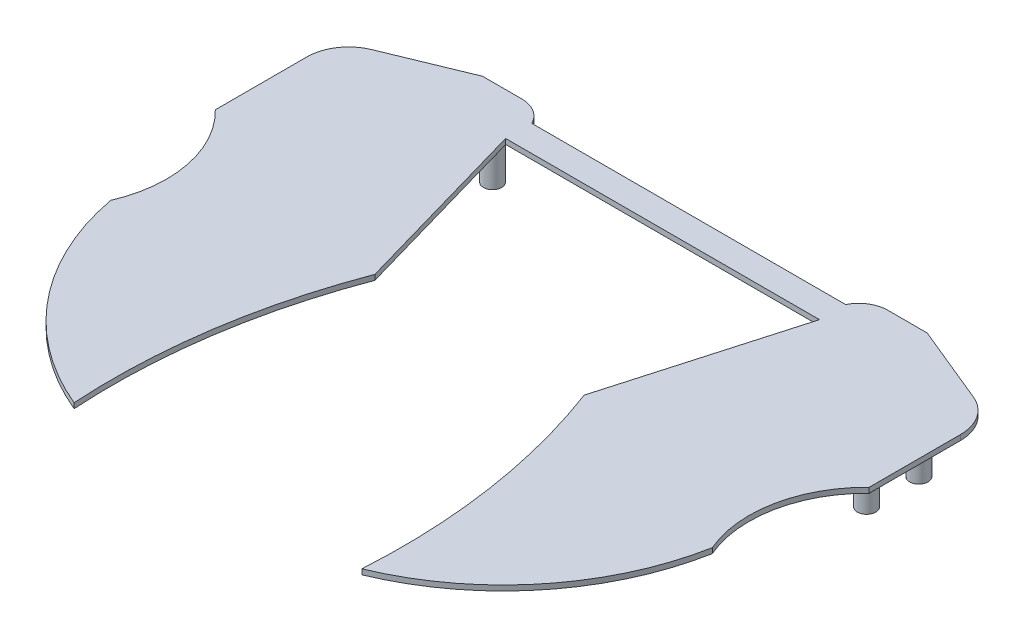
ISO-10303-21;
HEADER;
FILE_DESCRIPTION(('STEP AP214'),'2;1');
FILE_NAME('part.step','',(''),(''),'','','');
FILE_SCHEMA(('AUTOMOTIVE_DESIGN { 1 0 10303 214 1 1 1 1 }'));
ENDSEC;
DATA;
#1=APPLICATION_CONTEXT('core data for automotive mechanical design processes');
#2=APPLICATION_PROTOCOL_DEFINITION('international standard','automotive_design',2000,#1);
#3=PRODUCT_CONTEXT('',#1,'mechanical');
#4=PRODUCT('Part','Part','',(#3));
#5=PRODUCT_RELATED_PRODUCT_CATEGORY('part','',(#4));
#6=PRODUCT_DEFINITION_FORMATION('','',#4);
#7=PRODUCT_DEFINITION_CONTEXT('part definition',#1,'design');
#8=PRODUCT_DEFINITION('design','',#6,#7);
#9=PRODUCT_DEFINITION_SHAPE('','',#8);
#10=(LENGTH_UNIT() NAMED_UNIT(*) SI_UNIT(.MILLI.,.METRE.));
#11=(NAMED_UNIT(*) PLANE_ANGLE_UNIT() SI_UNIT($,.RADIAN.));
#12=(NAMED_UNIT(*) SI_UNIT($,.STERADIAN.) SOLID_ANGLE_UNIT());
#13=UNCERTAINTY_MEASURE_WITH_UNIT(LENGTH_MEASURE(1.E-05),#10,'distance_accuracy_value','');
#14=(GEOMETRIC_REPRESENTATION_CONTEXT(3) GLOBAL_UNCERTAINTY_ASSIGNED_CONTEXT((#13)) GLOBAL_UNIT_ASSIGNED_CONTEXT((#10,
#11,#12)) REPRESENTATION_CONTEXT('',''));
#15=CARTESIAN_POINT('',(0.,0.,0.));
#16=DIRECTION('',(0.,0.,1.));
#17=DIRECTION('',(1.,0.,0.));
#18=AXIS2_PLACEMENT_3D('',#15,#16,#17);
#19=CARTESIAN_POINT('',(0.,0.,0.));
#20=DIRECTION('',(0.,-1.,0.));
#21=DIRECTION('',(0.,0.,-1.));
#22=AXIS2_PLACEMENT_3D('',#19,#20,#21);
#23=PLANE('',#22);
#24=CARTESIAN_POINT('',(-138.43,0.,20.32));
#25=DIRECTION('',(0.,-1.,0.));
#26=DIRECTION('',(0.,0.,1.));
#27=AXIS2_PLACEMENT_3D('',#24,#25,#26);
#28=CIRCLE('',#27,4.445);
#29=CARTESIAN_POINT('',(-138.43,0.,24.765));
#30=VERTEX_POINT('',#29);
#31=EDGE_CURVE('E613',#30,#30,#28,.T.);
#32=ORIENTED_EDGE('',*,*,#31,.F.);
#33=EDGE_LOOP('',(#32));
#34=FACE_BOUND('',#33,.T.);
#35=CARTESIAN_POINT('',(138.43,0.,45.72));
#36=DIRECTION('',(0.,-1.,0.));
#37=DIRECTION('',(0.,0.,-1.));
#38=AXIS2_PLACEMENT_3D('',#35,#36,#37);
#39=CIRCLE('',#38,4.445);
#40=CARTESIAN_POINT('',(138.43,0.,41.275));
#41=VERTEX_POINT('',#40);
#42=EDGE_CURVE('E628',#41,#41,#39,.T.);
#43=ORIENTED_EDGE('',*,*,#42,.F.);
#44=EDGE_LOOP('',(#43));
#45=FACE_BOUND('',#44,.T.);
#46=CARTESIAN_POINT('',(88.9,0.,0.));
#47=DIRECTION('',(0.,-1.,0.));
#48=DIRECTION('',(0.,0.,-1.));
#49=AXIS2_PLACEMENT_3D('',#46,#47,#48);
#50=CIRCLE('',#49,4.445);
#51=CARTESIAN_POINT('',(88.9,0.,-4.445));
#52=VERTEX_POINT('',#51);
#53=EDGE_CURVE('E373',#52,#52,#50,.T.);
#54=ORIENTED_EDGE('',*,*,#53,.F.);
#55=EDGE_LOOP('',(#54));
#56=FACE_BOUND('',#55,.T.);
#57=DIRECTION('',(-1.,0.,0.));
#58=VECTOR('',#57,1.);
#59=CARTESIAN_POINT('',(-76.2,0.,-6.35));
#60=LINE('',#59,#58);
#61=CARTESIAN_POINT('',(76.2,0.,-6.34999999999999));
#62=VERTEX_POINT('',#61);
#63=CARTESIAN_POINT('',(-76.2,0.,-6.35));
#64=VERTEX_POINT('',#63);
#65=EDGE_CURVE('E61',#62,#64,#60,.T.);
#66=ORIENTED_EDGE('',*,*,#65,.F.);
#67=CARTESIAN_POINT('',(88.9,0.,0.));
#68=DIRECTION('',(0.,1.,0.));
#69=DIRECTION('',(0.,0.,-1.));
#70=AXIS2_PLACEMENT_3D('',#67,#68,#69);
#71=CIRCLE('',#70,14.1990316571237);
#72=CARTESIAN_POINT('',(88.9,0.,-14.1990316571237));
#73=VERTEX_POINT('',#72);
#74=EDGE_CURVE('E215',#73,#62,#71,.T.);
#75=ORIENTED_EDGE('',*,*,#74,.F.);
#76=DIRECTION('',(-1.,0.,0.));
#77=VECTOR('',#76,1.);
#78=CARTESIAN_POINT('',(88.9,0.,-14.1990316571237));
#79=LINE('',#78,#77);
#80=CARTESIAN_POINT('',(107.95,0.,-14.1990316571237));
#81=VERTEX_POINT('',#80);
#82=EDGE_CURVE('E213',#81,#73,#79,.T.);
#83=ORIENTED_EDGE('',*,*,#82,.F.);
#84=DIRECTION('',(-0.924735777509385,0.,-0.380609697451487));
#85=VECTOR('',#84,1.);
#86=CARTESIAN_POINT('',(107.95,0.,-14.1990316571237));
#87=LINE('',#86,#85);
#88=CARTESIAN_POINT('',(146.163989052214,0.,1.52936900100929));
#89=VERTEX_POINT('',#88);
#90=EDGE_CURVE('E189',#89,#81,#87,.T.);
#91=ORIENTED_EDGE('',*,*,#90,.F.);
#92=CARTESIAN_POINT('',(138.43,0.,20.32));
#93=DIRECTION('',(0.,1.,0.));
#94=DIRECTION('',(0.,0.,-1.));
#95=AXIS2_PLACEMENT_3D('',#92,#93,#94);
#96=CIRCLE('',#95,20.32);
#97=CARTESIAN_POINT('',(158.75,0.,20.32));
#98=VERTEX_POINT('',#97);
#99=EDGE_CURVE('E193',#98,#89,#96,.T.);
#100=ORIENTED_EDGE('',*,*,#99,.F.);
#101=DIRECTION('',(0.,0.,-1.));
#102=VECTOR('',#101,1.);
#103=CARTESIAN_POINT('',(158.75,0.,20.32));
#104=LINE('',#103,#102);
#105=CARTESIAN_POINT('',(158.75,0.,64.77));
#106=VERTEX_POINT('',#105);
#107=EDGE_CURVE('E226',#106,#98,#104,.T.);
#108=ORIENTED_EDGE('',*,*,#107,.F.);
#109=CARTESIAN_POINT('',(198.578348864442,0.,105.755669772888));
#110=DIRECTION('',(0.,-1.,0.));
#111=DIRECTION('',(0.,0.,1.));
#112=AXIS2_PLACEMENT_3D('',#109,#110,#111);
#113=CIRCLE('',#112,57.15);
#114=CARTESIAN_POINT('',(146.05,0.,128.27));
#115=VERTEX_POINT('',#114);
#116=EDGE_CURVE('E224',#115,#106,#113,.T.);
#117=ORIENTED_EDGE('',*,*,#116,.F.);
#118=CARTESIAN_POINT('',(21.2126731140536,0.,104.932437660043));
#119=DIRECTION('',(0.,1.,0.));
#120=DIRECTION('',(0.,0.,-1.));
#121=AXIS2_PLACEMENT_3D('',#118,#119,#120);
#122=CIRCLE('',#121,127.);
#123=CARTESIAN_POINT('',(69.85,0.,222.25));
#124=VERTEX_POINT('',#123);
#125=EDGE_CURVE('E222',#124,#115,#122,.T.);
#126=ORIENTED_EDGE('',*,*,#125,.F.);
#127=CARTESIAN_POINT('',(-234.338314354546,0.,202.949497153182));
#128=DIRECTION('',(0.,-1.,0.));
#129=DIRECTION('',(0.,0.,1.));
#130=AXIS2_PLACEMENT_3D('',#127,#128,#129);
#131=CIRCLE('',#130,304.8);
#132=CARTESIAN_POINT('',(50.8,0.,95.25));
#133=VERTEX_POINT('',#132);
#134=EDGE_CURVE('E220',#133,#124,#131,.T.);
#135=ORIENTED_EDGE('',*,*,#134,.F.);
#136=DIRECTION('',(-0.274721127897378,0.,0.961523947640823));
#137=VECTOR('',#136,1.);
#138=CARTESIAN_POINT('',(50.8,0.,95.25));
#139=LINE('',#138,#137);
#140=CARTESIAN_POINT('',(76.2,0.,6.35));
#141=VERTEX_POINT('',#140);
#142=EDGE_CURVE('E218',#141,#133,#139,.T.);
#143=ORIENTED_EDGE('',*,*,#142,.F.);
#144=DIRECTION('',(1.,0.,0.));
#145=VECTOR('',#144,1.);
#146=CARTESIAN_POINT('',(-76.2,0.,6.35));
#147=LINE('',#146,#145);
#148=CARTESIAN_POINT('',(-76.2,0.,6.35));
#149=VERTEX_POINT('',#148);
#150=EDGE_CURVE('E120',#149,#141,#147,.T.);
#151=ORIENTED_EDGE('',*,*,#150,.F.);
#152=DIRECTION('',(0.274721127897378,0.,0.961523947640823));
#153=VECTOR('',#152,1.);
#154=CARTESIAN_POINT('',(-50.8,0.,95.25));
#155=LINE('',#154,#153);
#156=CARTESIAN_POINT('',(-50.8,0.,95.25));
#157=VERTEX_POINT('',#156);
#158=EDGE_CURVE('E159',#149,#157,#155,.T.);
#159=ORIENTED_EDGE('',*,*,#158,.T.);
#160=CARTESIAN_POINT('',(234.338314354546,0.,202.949497153182));
#161=DIRECTION('',(0.,1.,0.));
#162=DIRECTION('',(0.,0.,1.));
#163=AXIS2_PLACEMENT_3D('',#160,#161,#162);
#164=CIRCLE('',#163,304.8);
#165=CARTESIAN_POINT('',(-69.85,0.,222.25));
#166=VERTEX_POINT('',#165);
#167=EDGE_CURVE('E156',#157,#166,#164,.T.);
#168=ORIENTED_EDGE('',*,*,#167,.T.);
#169=CARTESIAN_POINT('',(-21.2126731140536,0.,104.932437660043));
#170=DIRECTION('',(0.,-1.,0.));
#171=DIRECTION('',(0.,0.,-1.));
#172=AXIS2_PLACEMENT_3D('',#169,#170,#171);
#173=CIRCLE('',#172,127.);
#174=CARTESIAN_POINT('',(-146.05,0.,128.27));
#175=VERTEX_POINT('',#174);
#176=EDGE_CURVE('E153',#166,#175,#173,.T.);
#177=ORIENTED_EDGE('',*,*,#176,.T.);
#178=CARTESIAN_POINT('',(-198.578348864442,0.,105.755669772888));
#179=DIRECTION('',(0.,1.,0.));
#180=DIRECTION('',(0.,0.,1.));
#181=AXIS2_PLACEMENT_3D('',#178,#179,#180);
#182=CIRCLE('',#181,57.15);
#183=CARTESIAN_POINT('',(-158.75,0.,64.77));
#184=VERTEX_POINT('',#183);
#185=EDGE_CURVE('E150',#175,#184,#182,.T.);
#186=ORIENTED_EDGE('',*,*,#185,.T.);
#187=DIRECTION('',(0.,0.,-1.));
#188=VECTOR('',#187,1.);
#189=CARTESIAN_POINT('',(-158.75,0.,20.32));
#190=LINE('',#189,#188);
#191=CARTESIAN_POINT('',(-158.75,0.,20.32));
#192=VERTEX_POINT('',#191);
#193=EDGE_CURVE('E147',#184,#192,#190,.T.);
#194=ORIENTED_EDGE('',*,*,#193,.T.);
#195=CARTESIAN_POINT('',(-138.43,0.,20.32));
#196=DIRECTION('',(0.,-1.,0.));
#197=DIRECTION('',(0.,0.,-1.));
#198=AXIS2_PLACEMENT_3D('',#195,#196,#197);
#199=CIRCLE('',#198,20.32);
#200=CARTESIAN_POINT('',(-146.163989052214,0.,1.52936900100929));
#201=VERTEX_POINT('',#200);
#202=EDGE_CURVE('E143',#192,#201,#199,.T.);
#203=ORIENTED_EDGE('',*,*,#202,.T.);
#204=DIRECTION('',(0.924735777509385,0.,-0.380609697451487));
#205=VECTOR('',#204,1.);
#206=CARTESIAN_POINT('',(-107.95,0.,-14.1990316571237));
#207=LINE('',#206,#205);
#208=CARTESIAN_POINT('',(-107.95,0.,-14.1990316571237));
#209=VERTEX_POINT('',#208);
#210=EDGE_CURVE('E140',#201,#209,#207,.T.);
#211=ORIENTED_EDGE('',*,*,#210,.T.);
#212=DIRECTION('',(1.,0.,0.));
#213=VECTOR('',#212,1.);
#214=CARTESIAN_POINT('',(-88.9,0.,-14.1990316571237));
#215=LINE('',#214,#213);
#216=CARTESIAN_POINT('',(-88.9,0.,-14.1990316571237));
#217=VERTEX_POINT('',#216);
#218=EDGE_CURVE('E164',#209,#217,#215,.T.);
#219=ORIENTED_EDGE('',*,*,#218,.T.);
#220=CARTESIAN_POINT('',(-88.9,0.,0.));
#221=DIRECTION('',(0.,-1.,0.));
#222=DIRECTION('',(0.,0.,-1.));
#223=AXIS2_PLACEMENT_3D('',#220,#221,#222);
#224=CIRCLE('',#223,14.1990316571237);
#225=EDGE_CURVE('E162',#217,#64,#224,.T.);
#226=ORIENTED_EDGE('',*,*,#225,.T.);
#227=EDGE_LOOP('',(#66,#75,#83,#91,#100,#108,#117,#126,#135,#143,#151,#159,#168,#177,#186,#194,
#203,#211,#219,#226));
#228=FACE_BOUND('',#227,.T.);
#229=CARTESIAN_POINT('',(138.43,0.,20.32));
#230=DIRECTION('',(0.,-1.,0.));
#231=DIRECTION('',(0.,0.,-1.));
#232=AXIS2_PLACEMENT_3D('',#229,#230,#231);
#233=CIRCLE('',#232,4.445);
#234=CARTESIAN_POINT('',(138.43,0.,15.875));
#235=VERTEX_POINT('',#234);
#236=EDGE_CURVE('E634',#235,#235,#233,.T.);
#237=ORIENTED_EDGE('',*,*,#236,.F.);
#238=EDGE_LOOP('',(#237));
#239=FACE_BOUND('',#238,.T.);
#240=CARTESIAN_POINT('',(-138.43,0.,45.72));
#241=DIRECTION('',(0.,-1.,0.));
#242=DIRECTION('',(0.,0.,1.));
#243=AXIS2_PLACEMENT_3D('',#240,#241,#242);
#244=CIRCLE('',#243,4.445);
#245=CARTESIAN_POINT('',(-138.43,0.,50.165));
#246=VERTEX_POINT('',#245);
#247=EDGE_CURVE('E623',#246,#246,#244,.T.);
#248=ORIENTED_EDGE('',*,*,#247,.F.);
#249=EDGE_LOOP('',(#248));
#250=FACE_BOUND('',#249,.T.);
#251=CARTESIAN_POINT('',(-88.9,0.,0.));
#252=DIRECTION('',(0.,-1.,0.));
#253=DIRECTION('',(0.,0.,1.));
#254=AXIS2_PLACEMENT_3D('',#251,#252,#253);
#255=CIRCLE('',#254,4.445);
#256=CARTESIAN_POINT('',(-88.9,0.,4.445));
#257=VERTEX_POINT('',#256);
#258=EDGE_CURVE('E614',#257,#257,#255,.T.);
#259=ORIENTED_EDGE('',*,*,#258,.F.);
#260=EDGE_LOOP('',(#259));
#261=FACE_BOUND('',#260,.T.);
#262=ADVANCED_FACE('F33',(#34,#45,#56,#228,#239,#250,#261),#23,.T.);
#263=CARTESIAN_POINT('',(-76.2,2.54,-6.35));
#264=DIRECTION('',(0.,0.,1.));
#265=DIRECTION('',(1.,0.,0.));
#266=AXIS2_PLACEMENT_3D('',#263,#264,#265);
#267=PLANE('',#266);
#268=ORIENTED_EDGE('',*,*,#65,.T.);
#269=DIRECTION('',(0.,-1.,0.));
#270=VECTOR('',#269,1.);
#271=CARTESIAN_POINT('',(-76.2,2.54,-6.35));
#272=LINE('',#271,#270);
#273=CARTESIAN_POINT('',(-76.2,2.54,-6.35));
#274=VERTEX_POINT('',#273);
#275=EDGE_CURVE('E42',#274,#64,#272,.T.);
#276=ORIENTED_EDGE('',*,*,#275,.F.);
#277=DIRECTION('',(-1.,0.,0.));
#278=VECTOR('',#277,1.);
#279=CARTESIAN_POINT('',(-76.2,2.54,-6.35));
#280=LINE('',#279,#278);
#281=CARTESIAN_POINT('',(76.2,2.54,-6.35));
#282=VERTEX_POINT('',#281);
#283=EDGE_CURVE('E109',#282,#274,#280,.T.);
#284=ORIENTED_EDGE('',*,*,#283,.F.);
#285=DIRECTION('',(0.,-1.,0.));
#286=VECTOR('',#285,1.);
#287=CARTESIAN_POINT('',(76.2,2.54,-6.35));
#288=LINE('',#287,#286);
#289=EDGE_CURVE('E11',#282,#62,#288,.T.);
#290=ORIENTED_EDGE('',*,*,#289,.T.);
#291=EDGE_LOOP('',(#268,#276,#284,#290));
#292=FACE_BOUND('',#291,.T.);
#293=ADVANCED_FACE('F35',(#292),#267,.F.);
#294=CARTESIAN_POINT('',(-76.2,2.54,6.35));
#295=DIRECTION('',(0.,0.,-1.));
#296=DIRECTION('',(-1.,0.,0.));
#297=AXIS2_PLACEMENT_3D('',#294,#295,#296);
#298=PLANE('',#297);
#299=ORIENTED_EDGE('',*,*,#150,.T.);
#300=DIRECTION('',(0.,-1.,0.));
#301=VECTOR('',#300,1.);
#302=CARTESIAN_POINT('',(76.2,2.54,6.35));
#303=LINE('',#302,#301);
#304=CARTESIAN_POINT('',(76.2,2.54,6.35));
#305=VERTEX_POINT('',#304);
#306=EDGE_CURVE('E253',#305,#141,#303,.T.);
#307=ORIENTED_EDGE('',*,*,#306,.F.);
#308=DIRECTION('',(1.,0.,0.));
#309=VECTOR('',#308,1.);
#310=CARTESIAN_POINT('',(-76.2,2.54,6.35));
#311=LINE('',#310,#309);
#312=CARTESIAN_POINT('',(-76.2,2.54,6.35));
#313=VERTEX_POINT('',#312);
#314=EDGE_CURVE('E50',#313,#305,#311,.T.);
#315=ORIENTED_EDGE('',*,*,#314,.F.);
#316=DIRECTION('',(0.,-1.,0.));
#317=VECTOR('',#316,1.);
#318=CARTESIAN_POINT('',(-76.2,2.54,6.35));
#319=LINE('',#318,#317);
#320=EDGE_CURVE('E125',#313,#149,#319,.T.);
#321=ORIENTED_EDGE('',*,*,#320,.T.);
#322=EDGE_LOOP('',(#299,#307,#315,#321));
#323=FACE_BOUND('',#322,.T.);
#324=ADVANCED_FACE('F263',(#323),#298,.F.);
#325=CARTESIAN_POINT('',(0.,2.54,0.));
#326=DIRECTION('',(0.,-1.,0.));
#327=DIRECTION('',(0.,0.,-1.));
#328=AXIS2_PLACEMENT_3D('',#325,#326,#327);
#329=PLANE('',#328);
#330=ORIENTED_EDGE('',*,*,#314,.T.);
#331=DIRECTION('',(-0.274721127897378,0.,0.961523947640823));
#332=VECTOR('',#331,1.);
#333=CARTESIAN_POINT('',(50.8,2.54,95.25));
#334=LINE('',#333,#332);
#335=CARTESIAN_POINT('',(50.8,2.54,95.25));
#336=VERTEX_POINT('',#335);
#337=EDGE_CURVE('E196',#305,#336,#334,.T.);
#338=ORIENTED_EDGE('',*,*,#337,.T.);
#339=CARTESIAN_POINT('',(-234.338314354546,2.54,202.949497153182));
#340=DIRECTION('',(0.,-1.,0.));
#341=DIRECTION('',(0.,0.,1.));
#342=AXIS2_PLACEMENT_3D('',#339,#340,#341);
#343=CIRCLE('',#342,304.8);
#344=CARTESIAN_POINT('',(69.85,2.54,222.25));
#345=VERTEX_POINT('',#344);
#346=EDGE_CURVE('E198',#336,#345,#343,.T.);
#347=ORIENTED_EDGE('',*,*,#346,.T.);
#348=CARTESIAN_POINT('',(21.2126731140536,2.54,104.932437660043));
#349=DIRECTION('',(0.,1.,0.));
#350=DIRECTION('',(0.,0.,-1.));
#351=AXIS2_PLACEMENT_3D('',#348,#349,#350);
#352=CIRCLE('',#351,127.);
#353=CARTESIAN_POINT('',(146.05,2.54,128.27));
#354=VERTEX_POINT('',#353);
#355=EDGE_CURVE('E201',#345,#354,#352,.T.);
#356=ORIENTED_EDGE('',*,*,#355,.T.);
#357=CARTESIAN_POINT('',(198.578348864442,2.54,105.755669772888));
#358=DIRECTION('',(0.,-1.,0.));
#359=DIRECTION('',(0.,0.,1.));
#360=AXIS2_PLACEMENT_3D('',#357,#358,#359);
#361=CIRCLE('',#360,57.15);
#362=CARTESIAN_POINT('',(158.75,2.54,64.77));
#363=VERTEX_POINT('',#362);
#364=EDGE_CURVE('E204',#354,#363,#361,.T.);
#365=ORIENTED_EDGE('',*,*,#364,.T.);
#366=DIRECTION('',(0.,0.,-1.));
#367=VECTOR('',#366,1.);
#368=CARTESIAN_POINT('',(158.75,2.54,20.32));
#369=LINE('',#368,#367);
#370=CARTESIAN_POINT('',(158.75,2.54,20.32));
#371=VERTEX_POINT('',#370);
#372=EDGE_CURVE('E207',#363,#371,#369,.T.);
#373=ORIENTED_EDGE('',*,*,#372,.T.);
#374=CARTESIAN_POINT('',(138.43,2.54,20.32));
#375=DIRECTION('',(0.,1.,0.));
#376=DIRECTION('',(0.,0.,-1.));
#377=AXIS2_PLACEMENT_3D('',#374,#375,#376);
#378=CIRCLE('',#377,20.32);
#379=CARTESIAN_POINT('',(146.163989052214,2.54,1.52936900100929));
#380=VERTEX_POINT('',#379);
#381=EDGE_CURVE('E71',#371,#380,#378,.T.);
#382=ORIENTED_EDGE('',*,*,#381,.T.);
#383=DIRECTION('',(-0.924735777509385,0.,-0.380609697451487));
#384=VECTOR('',#383,1.);
#385=CARTESIAN_POINT('',(107.95,2.54,-14.1990316571237));
#386=LINE('',#385,#384);
#387=CARTESIAN_POINT('',(107.95,2.54,-14.1990316571237));
#388=VERTEX_POINT('',#387);
#389=EDGE_CURVE('E190',#380,#388,#386,.T.);
#390=ORIENTED_EDGE('',*,*,#389,.T.);
#391=DIRECTION('',(-1.,0.,0.));
#392=VECTOR('',#391,1.);
#393=CARTESIAN_POINT('',(88.9,2.54,-14.1990316571237));
#394=LINE('',#393,#392);
#395=CARTESIAN_POINT('',(88.9,2.54,-14.1990316571237));
#396=VERTEX_POINT('',#395);
#397=EDGE_CURVE('E192',#388,#396,#394,.T.);
#398=ORIENTED_EDGE('',*,*,#397,.T.);
#399=CARTESIAN_POINT('',(88.9,2.54,0.));
#400=DIRECTION('',(0.,1.,0.));
#401=DIRECTION('',(0.,0.,-1.));
#402=AXIS2_PLACEMENT_3D('',#399,#400,#401);
#403=CIRCLE('',#402,14.1990316571237);
#404=EDGE_CURVE('E118',#396,#282,#403,.T.);
#405=ORIENTED_EDGE('',*,*,#404,.T.);
#406=ORIENTED_EDGE('',*,*,#283,.T.);
#407=CARTESIAN_POINT('',(-88.9,2.54,0.));
#408=DIRECTION('',(0.,-1.,0.));
#409=DIRECTION('',(0.,0.,-1.));
#410=AXIS2_PLACEMENT_3D('',#407,#408,#409);
#411=CIRCLE('',#410,14.1990316571237);
#412=CARTESIAN_POINT('',(-88.9,2.54,-14.1990316571237));
#413=VERTEX_POINT('',#412);
#414=EDGE_CURVE('E114',#413,#274,#411,.T.);
#415=ORIENTED_EDGE('',*,*,#414,.F.);
#416=DIRECTION('',(1.,0.,0.));
#417=VECTOR('',#416,1.);
#418=CARTESIAN_POINT('',(-88.9,2.54,-14.1990316571237));
#419=LINE('',#418,#417);
#420=CARTESIAN_POINT('',(-107.95,2.54,-14.1990316571237));
#421=VERTEX_POINT('',#420);
#422=EDGE_CURVE('E130',#421,#413,#419,.T.);
#423=ORIENTED_EDGE('',*,*,#422,.F.);
#424=DIRECTION('',(0.924735777509385,0.,-0.380609697451487));
#425=VECTOR('',#424,1.);
#426=CARTESIAN_POINT('',(-107.95,2.54,-14.1990316571237));
#427=LINE('',#426,#425);
#428=CARTESIAN_POINT('',(-146.163989052214,2.54,1.52936900100929));
#429=VERTEX_POINT('',#428);
#430=EDGE_CURVE('E167',#429,#421,#427,.T.);
#431=ORIENTED_EDGE('',*,*,#430,.F.);
#432=CARTESIAN_POINT('',(-138.43,2.54,20.32));
#433=DIRECTION('',(0.,-1.,0.));
#434=DIRECTION('',(0.,0.,-1.));
#435=AXIS2_PLACEMENT_3D('',#432,#433,#434);
#436=CIRCLE('',#435,20.32);
#437=CARTESIAN_POINT('',(-158.75,2.54,20.32));
#438=VERTEX_POINT('',#437);
#439=EDGE_CURVE('E367',#438,#429,#436,.T.);
#440=ORIENTED_EDGE('',*,*,#439,.F.);
#441=DIRECTION('',(0.,0.,-1.));
#442=VECTOR('',#441,1.);
#443=CARTESIAN_POINT('',(-158.75,2.54,20.32));
#444=LINE('',#443,#442);
#445=CARTESIAN_POINT('',(-158.75,2.54,64.77));
#446=VERTEX_POINT('',#445);
#447=EDGE_CURVE('E363',#446,#438,#444,.T.);
#448=ORIENTED_EDGE('',*,*,#447,.F.);
#449=CARTESIAN_POINT('',(-198.578348864442,2.54,105.755669772888));
#450=DIRECTION('',(0.,1.,0.));
#451=DIRECTION('',(0.,0.,1.));
#452=AXIS2_PLACEMENT_3D('',#449,#450,#451);
#453=CIRCLE('',#452,57.15);
#454=CARTESIAN_POINT('',(-146.05,2.54,128.27));
#455=VERTEX_POINT('',#454);
#456=EDGE_CURVE('E377',#455,#446,#453,.T.);
#457=ORIENTED_EDGE('',*,*,#456,.F.);
#458=CARTESIAN_POINT('',(-21.2126731140536,2.54,104.932437660043));
#459=DIRECTION('',(0.,-1.,0.));
#460=DIRECTION('',(0.,0.,-1.));
#461=AXIS2_PLACEMENT_3D('',#458,#459,#460);
#462=CIRCLE('',#461,127.);
#463=CARTESIAN_POINT('',(-69.85,2.54,222.25));
#464=VERTEX_POINT('',#463);
#465=EDGE_CURVE('E348',#464,#455,#462,.T.);
#466=ORIENTED_EDGE('',*,*,#465,.F.);
#467=CARTESIAN_POINT('',(234.338314354546,2.54,202.949497153182));
#468=DIRECTION('',(0.,1.,0.));
#469=DIRECTION('',(0.,0.,1.));
#470=AXIS2_PLACEMENT_3D('',#467,#468,#469);
#471=CIRCLE('',#470,304.8);
#472=CARTESIAN_POINT('',(-50.8,2.54,95.25));
#473=VERTEX_POINT('',#472);
#474=EDGE_CURVE('E136',#473,#464,#471,.T.);
#475=ORIENTED_EDGE('',*,*,#474,.F.);
#476=DIRECTION('',(0.274721127897378,0.,0.961523947640823));
#477=VECTOR('',#476,1.);
#478=CARTESIAN_POINT('',(-50.8,2.54,95.25));
#479=LINE('',#478,#477);
#480=EDGE_CURVE('E131',#313,#473,#479,.T.);
#481=ORIENTED_EDGE('',*,*,#480,.F.);
#482=EDGE_LOOP('',(#330,#338,#347,#356,#365,#373,#382,#390,#398,#405,#406,#415,#423,#431,#440,
#448,#457,#466,#475,#481));
#483=FACE_BOUND('',#482,.T.);
#484=ADVANCED_FACE('F110',(#483),#329,.F.);
#485=CARTESIAN_POINT('',(107.95,2.54,-14.1990316571237));
#486=DIRECTION('',(-0.380609697451487,0.,0.924735777509385));
#487=DIRECTION('',(0.924735777509386,0.,0.380609697451487));
#488=AXIS2_PLACEMENT_3D('',#485,#486,#487);
#489=PLANE('',#488);
#490=ORIENTED_EDGE('',*,*,#90,.T.);
#491=DIRECTION('',(0.,-1.,0.));
#492=VECTOR('',#491,1.);
#493=CARTESIAN_POINT('',(107.95,2.54,-14.1990316571237));
#494=LINE('',#493,#492);
#495=EDGE_CURVE('E249',#388,#81,#494,.T.);
#496=ORIENTED_EDGE('',*,*,#495,.F.);
#497=ORIENTED_EDGE('',*,*,#389,.F.);
#498=DIRECTION('',(0.,-1.,0.));
#499=VECTOR('',#498,1.);
#500=CARTESIAN_POINT('',(146.163989052214,2.54,1.52936900100929));
#501=LINE('',#500,#499);
#502=EDGE_CURVE('E210',#380,#89,#501,.T.);
#503=ORIENTED_EDGE('',*,*,#502,.T.);
#504=EDGE_LOOP('',(#490,#496,#497,#503));
#505=FACE_BOUND('',#504,.T.);
#506=ADVANCED_FACE('F313',(#505),#489,.F.);
#507=CARTESIAN_POINT('',(88.9,2.54,-14.1990316571237));
#508=DIRECTION('',(0.,0.,1.));
#509=DIRECTION('',(1.,0.,0.));
#510=AXIS2_PLACEMENT_3D('',#507,#508,#509);
#511=PLANE('',#510);
#512=ORIENTED_EDGE('',*,*,#82,.T.);
#513=DIRECTION('',(0.,-1.,0.));
#514=VECTOR('',#513,1.);
#515=CARTESIAN_POINT('',(88.9,2.54,-14.1990316571237));
#516=LINE('',#515,#514);
#517=EDGE_CURVE('E246',#396,#73,#516,.T.);
#518=ORIENTED_EDGE('',*,*,#517,.F.);
#519=ORIENTED_EDGE('',*,*,#397,.F.);
#520=ORIENTED_EDGE('',*,*,#495,.T.);
#521=EDGE_LOOP('',(#512,#518,#519,#520));
#522=FACE_BOUND('',#521,.T.);
#523=ADVANCED_FACE('F316',(#522),#511,.F.);
#524=CARTESIAN_POINT('',(88.9,2.54,0.));
#525=DIRECTION('',(0.,-1.,0.));
#526=DIRECTION('',(0.,0.,-1.));
#527=AXIS2_PLACEMENT_3D('',#524,#525,#526);
#528=CYLINDRICAL_SURFACE('',#527,14.1990316571237);
#529=ORIENTED_EDGE('',*,*,#74,.T.);
#530=ORIENTED_EDGE('',*,*,#289,.F.);
#531=ORIENTED_EDGE('',*,*,#404,.F.);
#532=ORIENTED_EDGE('',*,*,#517,.T.);
#533=EDGE_LOOP('',(#529,#530,#531,#532));
#534=FACE_BOUND('',#533,.T.);
#535=ADVANCED_FACE('F319',(#534),#528,.T.);
#536=CARTESIAN_POINT('',(50.8,2.54,95.25));
#537=DIRECTION('',(0.961523947640823,0.,0.274721127897378));
#538=DIRECTION('',(0.274721127897378,0.,-0.961523947640823));
#539=AXIS2_PLACEMENT_3D('',#536,#537,#538);
#540=PLANE('',#539);
#541=ORIENTED_EDGE('',*,*,#142,.T.);
#542=DIRECTION('',(0.,-1.,0.));
#543=VECTOR('',#542,1.);
#544=CARTESIAN_POINT('',(50.8,2.54,95.25));
#545=LINE('',#544,#543);
#546=EDGE_CURVE('E243',#336,#133,#545,.T.);
#547=ORIENTED_EDGE('',*,*,#546,.F.);
#548=ORIENTED_EDGE('',*,*,#337,.F.);
#549=ORIENTED_EDGE('',*,*,#306,.T.);
#550=EDGE_LOOP('',(#541,#547,#548,#549));
#551=FACE_BOUND('',#550,.T.);
#552=ADVANCED_FACE('F421',(#551),#540,.F.);
#553=CARTESIAN_POINT('',(-234.338314354546,2.54,202.949497153182));
#554=DIRECTION('',(0.,-1.,0.));
#555=DIRECTION('',(0.,0.,-1.));
#556=AXIS2_PLACEMENT_3D('',#553,#554,#555);
#557=CYLINDRICAL_SURFACE('',#556,304.8);
#558=ORIENTED_EDGE('',*,*,#134,.T.);
#559=DIRECTION('',(0.,-1.,0.));
#560=VECTOR('',#559,1.);
#561=CARTESIAN_POINT('',(69.85,2.54,222.25));
#562=LINE('',#561,#560);
#563=EDGE_CURVE('E240',#345,#124,#562,.T.);
#564=ORIENTED_EDGE('',*,*,#563,.F.);
#565=ORIENTED_EDGE('',*,*,#346,.F.);
#566=ORIENTED_EDGE('',*,*,#546,.T.);
#567=EDGE_LOOP('',(#558,#564,#565,#566));
#568=FACE_BOUND('',#567,.T.);
#569=ADVANCED_FACE('F424',(#568),#557,.F.);
#570=CARTESIAN_POINT('',(21.2126731140536,2.54,104.932437660043));
#571=DIRECTION('',(0.,-1.,0.));
#572=DIRECTION('',(0.,0.,-1.));
#573=AXIS2_PLACEMENT_3D('',#570,#571,#572);
#574=CYLINDRICAL_SURFACE('',#573,127.);
#575=ORIENTED_EDGE('',*,*,#125,.T.);
#576=DIRECTION('',(0.,-1.,0.));
#577=VECTOR('',#576,1.);
#578=CARTESIAN_POINT('',(146.05,2.54,128.27));
#579=LINE('',#578,#577);
#580=EDGE_CURVE('E237',#354,#115,#579,.T.);
#581=ORIENTED_EDGE('',*,*,#580,.F.);
#582=ORIENTED_EDGE('',*,*,#355,.F.);
#583=ORIENTED_EDGE('',*,*,#563,.T.);
#584=EDGE_LOOP('',(#575,#581,#582,#583));
#585=FACE_BOUND('',#584,.T.);
#586=ADVANCED_FACE('F428',(#585),#574,.T.);
#587=CARTESIAN_POINT('',(198.578348864442,2.54,105.755669772888));
#588=DIRECTION('',(0.,-1.,0.));
#589=DIRECTION('',(0.,0.,-1.));
#590=AXIS2_PLACEMENT_3D('',#587,#588,#589);
#591=CYLINDRICAL_SURFACE('',#590,57.15);
#592=ORIENTED_EDGE('',*,*,#116,.T.);
#593=DIRECTION('',(0.,-1.,0.));
#594=VECTOR('',#593,1.);
#595=CARTESIAN_POINT('',(158.75,2.54,64.77));
#596=LINE('',#595,#594);
#597=EDGE_CURVE('E234',#363,#106,#596,.T.);
#598=ORIENTED_EDGE('',*,*,#597,.F.);
#599=ORIENTED_EDGE('',*,*,#364,.F.);
#600=ORIENTED_EDGE('',*,*,#580,.T.);
#601=EDGE_LOOP('',(#592,#598,#599,#600));
#602=FACE_BOUND('',#601,.T.);
#603=ADVANCED_FACE('F301',(#602),#591,.F.);
#604=CARTESIAN_POINT('',(158.75,2.54,20.32));
#605=DIRECTION('',(-1.,0.,0.));
#606=DIRECTION('',(0.,0.,1.));
#607=AXIS2_PLACEMENT_3D('',#604,#605,#606);
#608=PLANE('',#607);
#609=ORIENTED_EDGE('',*,*,#107,.T.);
#610=DIRECTION('',(0.,-1.,0.));
#611=VECTOR('',#610,1.);
#612=CARTESIAN_POINT('',(158.75,2.54,20.32));
#613=LINE('',#612,#611);
#614=EDGE_CURVE('E231',#371,#98,#613,.T.);
#615=ORIENTED_EDGE('',*,*,#614,.F.);
#616=ORIENTED_EDGE('',*,*,#372,.F.);
#617=ORIENTED_EDGE('',*,*,#597,.T.);
#618=EDGE_LOOP('',(#609,#615,#616,#617));
#619=FACE_BOUND('',#618,.T.);
#620=ADVANCED_FACE('F305',(#619),#608,.F.);
#621=CARTESIAN_POINT('',(138.43,2.54,20.32));
#622=DIRECTION('',(0.,-1.,0.));
#623=DIRECTION('',(0.,0.,-1.));
#624=AXIS2_PLACEMENT_3D('',#621,#622,#623);
#625=CYLINDRICAL_SURFACE('',#624,20.32);
#626=ORIENTED_EDGE('',*,*,#99,.T.);
#627=ORIENTED_EDGE('',*,*,#502,.F.);
#628=ORIENTED_EDGE('',*,*,#381,.F.);
#629=ORIENTED_EDGE('',*,*,#614,.T.);
#630=EDGE_LOOP('',(#626,#627,#628,#629));
#631=FACE_BOUND('',#630,.T.);
#632=ADVANCED_FACE('F308',(#631),#625,.T.);
#633=CARTESIAN_POINT('',(-107.95,2.54,-14.1990316571237));
#634=DIRECTION('',(-0.380609697451487,0.,-0.924735777509385));
#635=DIRECTION('',(-0.924735777509386,0.,0.380609697451487));
#636=AXIS2_PLACEMENT_3D('',#633,#634,#635);
#637=PLANE('',#636);
#638=ORIENTED_EDGE('',*,*,#210,.F.);
#639=DIRECTION('',(0.,-1.,0.));
#640=VECTOR('',#639,1.);
#641=CARTESIAN_POINT('',(-146.163989052214,2.54,1.52936900100929));
#642=LINE('',#641,#640);
#643=EDGE_CURVE('E186',#429,#201,#642,.T.);
#644=ORIENTED_EDGE('',*,*,#643,.F.);
#645=ORIENTED_EDGE('',*,*,#430,.T.);
#646=DIRECTION('',(0.,-1.,0.));
#647=VECTOR('',#646,1.);
#648=CARTESIAN_POINT('',(-107.95,2.54,-14.1990316571237));
#649=LINE('',#648,#647);
#650=EDGE_CURVE('E133',#421,#209,#649,.T.);
#651=ORIENTED_EDGE('',*,*,#650,.T.);
#652=EDGE_LOOP('',(#638,#644,#645,#651));
#653=FACE_BOUND('',#652,.T.);
#654=ADVANCED_FACE('F369',(#653),#637,.T.);
#655=CARTESIAN_POINT('',(-138.43,2.54,20.32));
#656=DIRECTION('',(0.,-1.,0.));
#657=DIRECTION('',(0.,0.,-1.));
#658=AXIS2_PLACEMENT_3D('',#655,#656,#657);
#659=CYLINDRICAL_SURFACE('',#658,20.32);
#660=ORIENTED_EDGE('',*,*,#202,.F.);
#661=DIRECTION('',(0.,-1.,0.));
#662=VECTOR('',#661,1.);
#663=CARTESIAN_POINT('',(-158.75,2.54,20.32));
#664=LINE('',#663,#662);
#665=EDGE_CURVE('E183',#438,#192,#664,.T.);
#666=ORIENTED_EDGE('',*,*,#665,.F.);
#667=ORIENTED_EDGE('',*,*,#439,.T.);
#668=ORIENTED_EDGE('',*,*,#643,.T.);
#669=EDGE_LOOP('',(#660,#666,#667,#668));
#670=FACE_BOUND('',#669,.T.);
#671=ADVANCED_FACE('F365',(#670),#659,.T.);
#672=CARTESIAN_POINT('',(-158.75,2.54,20.32));
#673=DIRECTION('',(-1.,0.,0.));
#674=DIRECTION('',(0.,0.,1.));
#675=AXIS2_PLACEMENT_3D('',#672,#673,#674);
#676=PLANE('',#675);
#677=ORIENTED_EDGE('',*,*,#193,.F.);
#678=DIRECTION('',(0.,-1.,0.));
#679=VECTOR('',#678,1.);
#680=CARTESIAN_POINT('',(-158.75,2.54,64.77));
#681=LINE('',#680,#679);
#682=EDGE_CURVE('E180',#446,#184,#681,.T.);
#683=ORIENTED_EDGE('',*,*,#682,.F.);
#684=ORIENTED_EDGE('',*,*,#447,.T.);
#685=ORIENTED_EDGE('',*,*,#665,.T.);
#686=EDGE_LOOP('',(#677,#683,#684,#685));
#687=FACE_BOUND('',#686,.T.);
#688=ADVANCED_FACE('F357',(#687),#676,.T.);
#689=CARTESIAN_POINT('',(-198.578348864442,2.54,105.755669772888));
#690=DIRECTION('',(0.,-1.,0.));
#691=DIRECTION('',(0.,0.,-1.));
#692=AXIS2_PLACEMENT_3D('',#689,#690,#691);
#693=CYLINDRICAL_SURFACE('',#692,57.15);
#694=ORIENTED_EDGE('',*,*,#185,.F.);
#695=DIRECTION('',(0.,-1.,0.));
#696=VECTOR('',#695,1.);
#697=CARTESIAN_POINT('',(-146.05,2.54,128.27));
#698=LINE('',#697,#696);
#699=EDGE_CURVE('E177',#455,#175,#698,.T.);
#700=ORIENTED_EDGE('',*,*,#699,.F.);
#701=ORIENTED_EDGE('',*,*,#456,.T.);
#702=ORIENTED_EDGE('',*,*,#682,.T.);
#703=EDGE_LOOP('',(#694,#700,#701,#702));
#704=FACE_BOUND('',#703,.T.);
#705=ADVANCED_FACE('F352',(#704),#693,.F.);
#706=CARTESIAN_POINT('',(-21.2126731140536,2.54,104.932437660043));
#707=DIRECTION('',(0.,-1.,0.));
#708=DIRECTION('',(0.,0.,-1.));
#709=AXIS2_PLACEMENT_3D('',#706,#707,#708);
#710=CYLINDRICAL_SURFACE('',#709,127.);
#711=ORIENTED_EDGE('',*,*,#176,.F.);
#712=DIRECTION('',(0.,-1.,0.));
#713=VECTOR('',#712,1.);
#714=CARTESIAN_POINT('',(-69.85,2.54,222.25));
#715=LINE('',#714,#713);
#716=EDGE_CURVE('E174',#464,#166,#715,.T.);
#717=ORIENTED_EDGE('',*,*,#716,.F.);
#718=ORIENTED_EDGE('',*,*,#465,.T.);
#719=ORIENTED_EDGE('',*,*,#699,.T.);
#720=EDGE_LOOP('',(#711,#717,#718,#719));
#721=FACE_BOUND('',#720,.T.);
#722=ADVANCED_FACE('F344',(#721),#710,.T.);
#723=CARTESIAN_POINT('',(234.338314354546,2.54,202.949497153182));
#724=DIRECTION('',(0.,-1.,0.));
#725=DIRECTION('',(0.,0.,-1.));
#726=AXIS2_PLACEMENT_3D('',#723,#724,#725);
#727=CYLINDRICAL_SURFACE('',#726,304.8);
#728=ORIENTED_EDGE('',*,*,#167,.F.);
#729=DIRECTION('',(0.,-1.,0.));
#730=VECTOR('',#729,1.);
#731=CARTESIAN_POINT('',(-50.8,2.54,95.25));
#732=LINE('',#731,#730);
#733=EDGE_CURVE('E171',#473,#157,#732,.T.);
#734=ORIENTED_EDGE('',*,*,#733,.F.);
#735=ORIENTED_EDGE('',*,*,#474,.T.);
#736=ORIENTED_EDGE('',*,*,#716,.T.);
#737=EDGE_LOOP('',(#728,#734,#735,#736));
#738=FACE_BOUND('',#737,.T.);
#739=ADVANCED_FACE('F383',(#738),#727,.F.);
#740=CARTESIAN_POINT('',(-50.8,2.54,95.25));
#741=DIRECTION('',(0.961523947640823,0.,-0.274721127897378));
#742=DIRECTION('',(-0.274721127897378,0.,-0.961523947640823));
#743=AXIS2_PLACEMENT_3D('',#740,#741,#742);
#744=PLANE('',#743);
#745=ORIENTED_EDGE('',*,*,#158,.F.);
#746=ORIENTED_EDGE('',*,*,#320,.F.);
#747=ORIENTED_EDGE('',*,*,#480,.T.);
#748=ORIENTED_EDGE('',*,*,#733,.T.);
#749=EDGE_LOOP('',(#745,#746,#747,#748));
#750=FACE_BOUND('',#749,.T.);
#751=ADVANCED_FACE('F269',(#750),#744,.T.);
#752=CARTESIAN_POINT('',(-88.9,2.54,0.));
#753=DIRECTION('',(0.,-1.,0.));
#754=DIRECTION('',(0.,0.,-1.));
#755=AXIS2_PLACEMENT_3D('',#752,#753,#754);
#756=CYLINDRICAL_SURFACE('',#755,14.1990316571237);
#757=ORIENTED_EDGE('',*,*,#225,.F.);
#758=DIRECTION('',(0.,-1.,0.));
#759=VECTOR('',#758,1.);
#760=CARTESIAN_POINT('',(-88.9,2.54,-14.1990316571237));
#761=LINE('',#760,#759);
#762=EDGE_CURVE('E129',#413,#217,#761,.T.);
#763=ORIENTED_EDGE('',*,*,#762,.F.);
#764=ORIENTED_EDGE('',*,*,#414,.T.);
#765=ORIENTED_EDGE('',*,*,#275,.T.);
#766=EDGE_LOOP('',(#757,#763,#764,#765));
#767=FACE_BOUND('',#766,.T.);
#768=ADVANCED_FACE('F127',(#767),#756,.T.);
#769=CARTESIAN_POINT('',(-88.9,2.54,-14.1990316571237));
#770=DIRECTION('',(0.,0.,-1.));
#771=DIRECTION('',(-1.,0.,0.));
#772=AXIS2_PLACEMENT_3D('',#769,#770,#771);
#773=PLANE('',#772);
#774=ORIENTED_EDGE('',*,*,#218,.F.);
#775=ORIENTED_EDGE('',*,*,#650,.F.);
#776=ORIENTED_EDGE('',*,*,#422,.T.);
#777=ORIENTED_EDGE('',*,*,#762,.T.);
#778=EDGE_LOOP('',(#774,#775,#776,#777));
#779=FACE_BOUND('',#778,.T.);
#780=ADVANCED_FACE('F324',(#779),#773,.T.);
#781=CARTESIAN_POINT('',(88.9,-25.4,0.));
#782=DIRECTION('',(0.,1.,0.));
#783=DIRECTION('',(0.,0.,1.));
#784=AXIS2_PLACEMENT_3D('',#781,#782,#783);
#785=CYLINDRICAL_SURFACE('',#784,4.445);
#786=CARTESIAN_POINT('',(88.9,-25.4,0.));
#787=DIRECTION('',(0.,-1.,0.));
#788=DIRECTION('',(0.,0.,-1.));
#789=AXIS2_PLACEMENT_3D('',#786,#787,#788);
#790=CIRCLE('',#789,4.445);
#791=CARTESIAN_POINT('',(88.9,-25.4,-4.445));
#792=VERTEX_POINT('',#791);
#793=EDGE_CURVE('E144',#792,#792,#790,.T.);
#794=ORIENTED_EDGE('',*,*,#793,.F.);
#795=EDGE_LOOP('',(#794));
#796=FACE_BOUND('',#795,.T.);
#797=ORIENTED_EDGE('',*,*,#53,.T.);
#798=EDGE_LOOP('',(#797));
#799=FACE_BOUND('',#798,.T.);
#800=ADVANCED_FACE('F480',(#796,#799),#785,.T.);
#801=CARTESIAN_POINT('',(88.9,-25.4,0.));
#802=DIRECTION('',(0.,-1.,0.));
#803=DIRECTION('',(0.,0.,-1.));
#804=AXIS2_PLACEMENT_3D('',#801,#802,#803);
#805=PLANE('',#804);
#806=ORIENTED_EDGE('',*,*,#793,.T.);
#807=EDGE_LOOP('',(#806));
#808=FACE_BOUND('',#807,.T.);
#809=ADVANCED_FACE('F496',(#808),#805,.T.);
#810=CARTESIAN_POINT('',(138.43,-25.4,20.32));
#811=DIRECTION('',(0.,1.,0.));
#812=DIRECTION('',(0.,0.,1.));
#813=AXIS2_PLACEMENT_3D('',#810,#811,#812);
#814=CYLINDRICAL_SURFACE('',#813,4.445);
#815=CARTESIAN_POINT('',(138.43,-25.4,20.32));
#816=DIRECTION('',(0.,-1.,0.));
#817=DIRECTION('',(0.,0.,-1.));
#818=AXIS2_PLACEMENT_3D('',#815,#816,#817);
#819=CIRCLE('',#818,4.445);
#820=CARTESIAN_POINT('',(138.43,-25.4,15.875));
#821=VERTEX_POINT('',#820);
#822=EDGE_CURVE('E637',#821,#821,#819,.T.);
#823=ORIENTED_EDGE('',*,*,#822,.F.);
#824=EDGE_LOOP('',(#823));
#825=FACE_BOUND('',#824,.T.);
#826=ORIENTED_EDGE('',*,*,#236,.T.);
#827=EDGE_LOOP('',(#826));
#828=FACE_BOUND('',#827,.T.);
#829=ADVANCED_FACE('F506',(#825,#828),#814,.T.);
#830=CARTESIAN_POINT('',(138.43,-25.4,20.32));
#831=DIRECTION('',(0.,-1.,0.));
#832=DIRECTION('',(0.,0.,-1.));
#833=AXIS2_PLACEMENT_3D('',#830,#831,#832);
#834=PLANE('',#833);
#835=ORIENTED_EDGE('',*,*,#822,.T.);
#836=EDGE_LOOP('',(#835));
#837=FACE_BOUND('',#836,.T.);
#838=ADVANCED_FACE('F516',(#837),#834,.T.);
#839=CARTESIAN_POINT('',(138.43,-25.4,45.72));
#840=DIRECTION('',(0.,1.,0.));
#841=DIRECTION('',(0.,0.,1.));
#842=AXIS2_PLACEMENT_3D('',#839,#840,#841);
#843=CYLINDRICAL_SURFACE('',#842,4.445);
#844=CARTESIAN_POINT('',(138.43,-25.4,45.72));
#845=DIRECTION('',(0.,-1.,0.));
#846=DIRECTION('',(0.,0.,-1.));
#847=AXIS2_PLACEMENT_3D('',#844,#845,#846);
#848=CIRCLE('',#847,4.445);
#849=CARTESIAN_POINT('',(138.43,-25.4,41.275));
#850=VERTEX_POINT('',#849);
#851=EDGE_CURVE('E631',#850,#850,#848,.T.);
#852=ORIENTED_EDGE('',*,*,#851,.F.);
#853=EDGE_LOOP('',(#852));
#854=FACE_BOUND('',#853,.T.);
#855=ORIENTED_EDGE('',*,*,#42,.T.);
#856=EDGE_LOOP('',(#855));
#857=FACE_BOUND('',#856,.T.);
#858=ADVANCED_FACE('F526',(#854,#857),#843,.T.);
#859=CARTESIAN_POINT('',(138.43,-25.4,45.72));
#860=DIRECTION('',(0.,-1.,0.));
#861=DIRECTION('',(0.,0.,-1.));
#862=AXIS2_PLACEMENT_3D('',#859,#860,#861);
#863=PLANE('',#862);
#864=ORIENTED_EDGE('',*,*,#851,.T.);
#865=EDGE_LOOP('',(#864));
#866=FACE_BOUND('',#865,.T.);
#867=ADVANCED_FACE('F536',(#866),#863,.T.);
#868=CARTESIAN_POINT('',(-138.43,-25.4,45.72));
#869=DIRECTION('',(0.,1.,0.));
#870=DIRECTION('',(0.,0.,1.));
#871=AXIS2_PLACEMENT_3D('',#868,#869,#870);
#872=CYLINDRICAL_SURFACE('',#871,4.445);
#873=CARTESIAN_POINT('',(-138.43,-25.4,45.72));
#874=DIRECTION('',(0.,-1.,0.));
#875=DIRECTION('',(0.,0.,1.));
#876=AXIS2_PLACEMENT_3D('',#873,#874,#875);
#877=CIRCLE('',#876,4.445);
#878=CARTESIAN_POINT('',(-138.43,-25.4,50.165));
#879=VERTEX_POINT('',#878);
#880=EDGE_CURVE('E625',#879,#879,#877,.T.);
#881=ORIENTED_EDGE('',*,*,#880,.F.);
#882=EDGE_LOOP('',(#881));
#883=FACE_BOUND('',#882,.T.);
#884=ORIENTED_EDGE('',*,*,#247,.T.);
#885=EDGE_LOOP('',(#884));
#886=FACE_BOUND('',#885,.T.);
#887=ADVANCED_FACE('F546',(#883,#886),#872,.T.);
#888=CARTESIAN_POINT('',(-138.43,-25.4,45.72));
#889=DIRECTION('',(0.,1.,0.));
#890=DIRECTION('',(0.,0.,1.));
#891=AXIS2_PLACEMENT_3D('',#888,#889,#890);
#892=PLANE('',#891);
#893=ORIENTED_EDGE('',*,*,#880,.T.);
#894=EDGE_LOOP('',(#893));
#895=FACE_BOUND('',#894,.T.);
#896=ADVANCED_FACE('F556',(#895),#892,.F.);
#897=CARTESIAN_POINT('',(-138.43,-25.4,20.32));
#898=DIRECTION('',(0.,1.,0.));
#899=DIRECTION('',(0.,0.,1.));
#900=AXIS2_PLACEMENT_3D('',#897,#898,#899);
#901=CYLINDRICAL_SURFACE('',#900,4.445);
#902=CARTESIAN_POINT('',(-138.43,-25.4,20.32));
#903=DIRECTION('',(0.,-1.,0.));
#904=DIRECTION('',(0.,0.,1.));
#905=AXIS2_PLACEMENT_3D('',#902,#903,#904);
#906=CIRCLE('',#905,4.445);
#907=CARTESIAN_POINT('',(-138.43,-25.4,24.765));
#908=VERTEX_POINT('',#907);
#909=EDGE_CURVE('E617',#908,#908,#906,.T.);
#910=ORIENTED_EDGE('',*,*,#909,.F.);
#911=EDGE_LOOP('',(#910));
#912=FACE_BOUND('',#911,.T.);
#913=ORIENTED_EDGE('',*,*,#31,.T.);
#914=EDGE_LOOP('',(#913));
#915=FACE_BOUND('',#914,.T.);
#916=ADVANCED_FACE('F566',(#912,#915),#901,.T.);
#917=CARTESIAN_POINT('',(-138.43,-25.4,20.32));
#918=DIRECTION('',(0.,1.,0.));
#919=DIRECTION('',(0.,0.,1.));
#920=AXIS2_PLACEMENT_3D('',#917,#918,#919);
#921=PLANE('',#920);
#922=ORIENTED_EDGE('',*,*,#909,.T.);
#923=EDGE_LOOP('',(#922));
#924=FACE_BOUND('',#923,.T.);
#925=ADVANCED_FACE('F576',(#924),#921,.F.);
#926=CARTESIAN_POINT('',(-88.9,-25.4,0.));
#927=DIRECTION('',(0.,1.,0.));
#928=DIRECTION('',(0.,0.,1.));
#929=AXIS2_PLACEMENT_3D('',#926,#927,#928);
#930=CYLINDRICAL_SURFACE('',#929,4.445);
#931=CARTESIAN_POINT('',(-88.9,-25.4,0.));
#932=DIRECTION('',(0.,-1.,0.));
#933=DIRECTION('',(0.,0.,1.));
#934=AXIS2_PLACEMENT_3D('',#931,#932,#933);
#935=CIRCLE('',#934,4.445);
#936=CARTESIAN_POINT('',(-88.9,-25.4,4.445));
#937=VERTEX_POINT('',#936);
#938=EDGE_CURVE('E612',#937,#937,#935,.T.);
#939=ORIENTED_EDGE('',*,*,#938,.F.);
#940=EDGE_LOOP('',(#939));
#941=FACE_BOUND('',#940,.T.);
#942=ORIENTED_EDGE('',*,*,#258,.T.);
#943=EDGE_LOOP('',(#942));
#944=FACE_BOUND('',#943,.T.);
#945=ADVANCED_FACE('F586',(#941,#944),#930,.T.);
#946=CARTESIAN_POINT('',(-88.9,-25.4,0.));
#947=DIRECTION('',(0.,1.,0.));
#948=DIRECTION('',(0.,0.,1.));
#949=AXIS2_PLACEMENT_3D('',#946,#947,#948);
#950=PLANE('',#949);
#951=ORIENTED_EDGE('',*,*,#938,.T.);
#952=EDGE_LOOP('',(#951));
#953=FACE_BOUND('',#952,.T.);
#954=ADVANCED_FACE('F596',(#953),#950,.F.);
#955=CLOSED_SHELL('',(#262,#293,#324,#484,#506,#523,#535,#552,#569,#586,#603,#620,#632,#654,
#671,#688,#705,#722,#739,#751,#768,#780,#800,#809,#829,#838,#858,#867,#887,#896,#916,#925,#945,#954));
#956=MANIFOLD_SOLID_BREP('B2',#955);
#957=ADVANCED_BREP_SHAPE_REPRESENTATION('',(#18,#956),#14);
#958=SHAPE_DEFINITION_REPRESENTATION(#9,#957);
ENDSEC;
END-ISO-10303-21;
